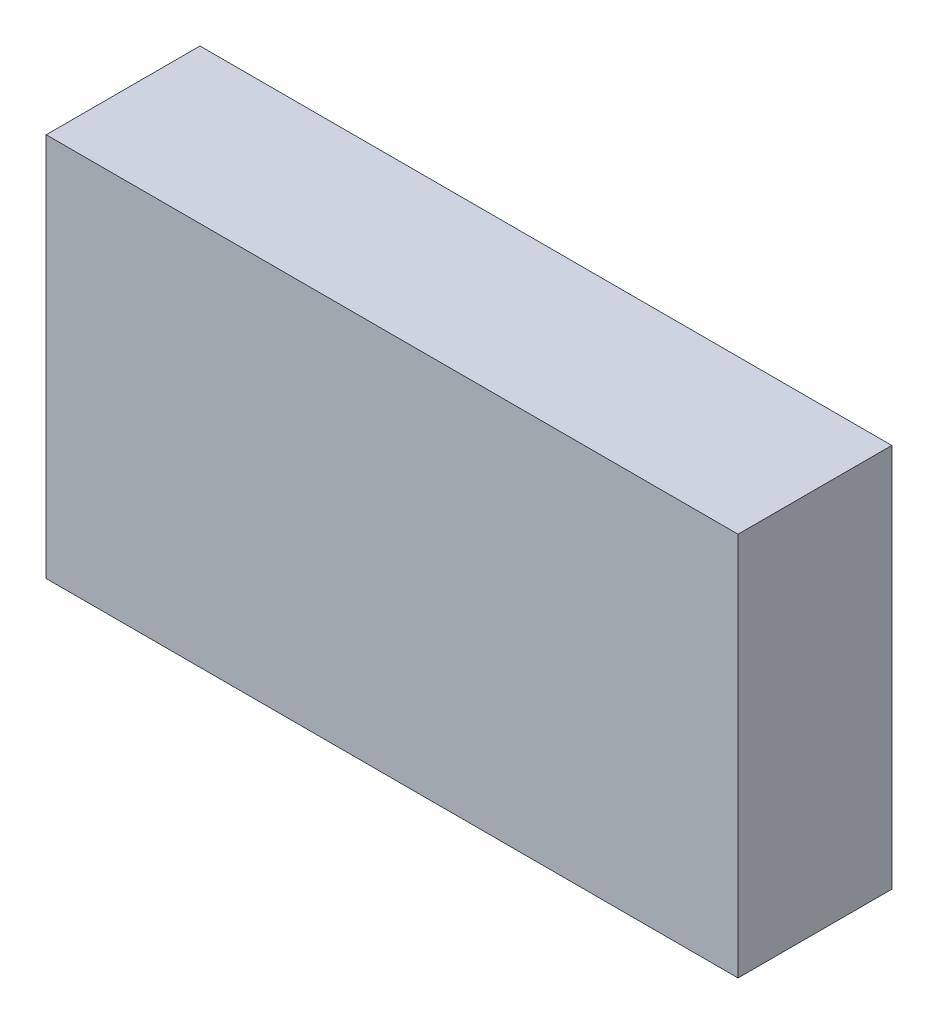
ISO-10303-21;
HEADER;
FILE_DESCRIPTION(('STEP AP214'),'2;1');
FILE_NAME('part.step','',(''),(''),'','','');
FILE_SCHEMA(('AUTOMOTIVE_DESIGN { 1 0 10303 214 1 1 1 1 }'));
ENDSEC;
DATA;
#1=APPLICATION_CONTEXT('core data for automotive mechanical design processes');
#2=APPLICATION_PROTOCOL_DEFINITION('international standard','automotive_design',2000,#1);
#3=PRODUCT_CONTEXT('',#1,'mechanical');
#4=PRODUCT('Part','Part','',(#3));
#5=PRODUCT_RELATED_PRODUCT_CATEGORY('part','',(#4));
#6=PRODUCT_DEFINITION_FORMATION('','',#4);
#7=PRODUCT_DEFINITION_CONTEXT('part definition',#1,'design');
#8=PRODUCT_DEFINITION('design','',#6,#7);
#9=PRODUCT_DEFINITION_SHAPE('','',#8);
#10=(LENGTH_UNIT() NAMED_UNIT(*) SI_UNIT(.MILLI.,.METRE.));
#11=(NAMED_UNIT(*) PLANE_ANGLE_UNIT() SI_UNIT($,.RADIAN.));
#12=(NAMED_UNIT(*) SI_UNIT($,.STERADIAN.) SOLID_ANGLE_UNIT());
#13=UNCERTAINTY_MEASURE_WITH_UNIT(LENGTH_MEASURE(1.E-05),#10,'distance_accuracy_value','');
#14=(GEOMETRIC_REPRESENTATION_CONTEXT(3) GLOBAL_UNCERTAINTY_ASSIGNED_CONTEXT((#13)) GLOBAL_UNIT_ASSIGNED_CONTEXT((#10,
#11,#12)) REPRESENTATION_CONTEXT('',''));
#15=CARTESIAN_POINT('',(0.,0.,0.));
#16=DIRECTION('',(0.,0.,1.));
#17=DIRECTION('',(1.,0.,0.));
#18=AXIS2_PLACEMENT_3D('',#15,#16,#17);
#19=CARTESIAN_POINT('',(1.6,-1.125,0.));
#20=DIRECTION('',(1.,0.,0.));
#21=DIRECTION('',(0.,0.,1.));
#22=AXIS2_PLACEMENT_3D('',#19,#20,#21);
#23=PLANE('',#22);
#24=DIRECTION('',(0.,1.,0.));
#25=VECTOR('',#24,1.);
#26=CARTESIAN_POINT('',(1.6,-1.125,0.1));
#27=LINE('',#26,#25);
#28=CARTESIAN_POINT('',(1.6,-1.125,0.1));
#29=VERTEX_POINT('',#28);
#30=CARTESIAN_POINT('',(1.6,-0.875,0.1));
#31=VERTEX_POINT('',#30);
#32=EDGE_CURVE('E11',#29,#31,#27,.T.);
#33=ORIENTED_EDGE('',*,*,#32,.T.);
#34=DIRECTION('',(0.,0.,1.));
#35=VECTOR('',#34,1.);
#36=CARTESIAN_POINT('',(1.6,-0.875,0.));
#37=LINE('',#36,#35);
#38=CARTESIAN_POINT('',(1.6,-0.875,0.));
#39=VERTEX_POINT('',#38);
#40=EDGE_CURVE('E24',#39,#31,#37,.T.);
#41=ORIENTED_EDGE('',*,*,#40,.F.);
#42=DIRECTION('',(0.,1.,0.));
#43=VECTOR('',#42,1.);
#44=CARTESIAN_POINT('',(1.6,-1.125,0.));
#45=LINE('',#44,#43);
#46=CARTESIAN_POINT('',(1.6,-1.125,0.));
#47=VERTEX_POINT('',#46);
#48=EDGE_CURVE('E86',#47,#39,#45,.T.);
#49=ORIENTED_EDGE('',*,*,#48,.F.);
#50=DIRECTION('',(0.,0.,1.));
#51=VECTOR('',#50,1.);
#52=CARTESIAN_POINT('',(1.6,-1.125,0.));
#53=LINE('',#52,#51);
#54=EDGE_CURVE('E36',#47,#29,#53,.T.);
#55=ORIENTED_EDGE('',*,*,#54,.T.);
#56=EDGE_LOOP('',(#33,#41,#49,#55));
#57=FACE_BOUND('',#56,.T.);
#58=ADVANCED_FACE('F17',(#57),#23,.F.);
#59=CARTESIAN_POINT('',(2.05,-1.125,0.));
#60=DIRECTION('',(1.,0.,0.));
#61=DIRECTION('',(0.,0.,1.));
#62=AXIS2_PLACEMENT_3D('',#59,#60,#61);
#63=PLANE('',#62);
#64=DIRECTION('',(0.,0.,1.));
#65=VECTOR('',#64,1.);
#66=CARTESIAN_POINT('',(2.05,-1.125,0.));
#67=LINE('',#66,#65);
#68=CARTESIAN_POINT('',(2.05,-1.125,0.));
#69=VERTEX_POINT('',#68);
#70=CARTESIAN_POINT('',(2.05,-1.125,0.1));
#71=VERTEX_POINT('',#70);
#72=EDGE_CURVE('E83',#69,#71,#67,.T.);
#73=ORIENTED_EDGE('',*,*,#72,.F.);
#74=DIRECTION('',(0.,1.,0.));
#75=VECTOR('',#74,1.);
#76=CARTESIAN_POINT('',(2.05,-1.125,0.));
#77=LINE('',#76,#75);
#78=CARTESIAN_POINT('',(2.05,-0.875,0.));
#79=VERTEX_POINT('',#78);
#80=EDGE_CURVE('E63',#69,#79,#77,.T.);
#81=ORIENTED_EDGE('',*,*,#80,.T.);
#82=DIRECTION('',(0.,0.,1.));
#83=VECTOR('',#82,1.);
#84=CARTESIAN_POINT('',(2.05,-0.875,0.));
#85=LINE('',#84,#83);
#86=CARTESIAN_POINT('',(2.05,-0.875,0.1));
#87=VERTEX_POINT('',#86);
#88=EDGE_CURVE('E57',#79,#87,#85,.T.);
#89=ORIENTED_EDGE('',*,*,#88,.T.);
#90=DIRECTION('',(0.,1.,0.));
#91=VECTOR('',#90,1.);
#92=CARTESIAN_POINT('',(2.05,-1.125,0.1));
#93=LINE('',#92,#91);
#94=EDGE_CURVE('E60',#71,#87,#93,.T.);
#95=ORIENTED_EDGE('',*,*,#94,.F.);
#96=EDGE_LOOP('',(#73,#81,#89,#95));
#97=FACE_BOUND('',#96,.T.);
#98=ADVANCED_FACE('F59',(#97),#63,.T.);
#99=CARTESIAN_POINT('',(1.6,-1.125,0.));
#100=DIRECTION('',(0.,1.,0.));
#101=DIRECTION('',(0.,0.,1.));
#102=AXIS2_PLACEMENT_3D('',#99,#100,#101);
#103=PLANE('',#102);
#104=ORIENTED_EDGE('',*,*,#72,.T.);
#105=DIRECTION('',(1.,0.,0.));
#106=VECTOR('',#105,1.);
#107=CARTESIAN_POINT('',(1.6,-1.125,0.1));
#108=LINE('',#107,#106);
#109=EDGE_CURVE('E71',#29,#71,#108,.T.);
#110=ORIENTED_EDGE('',*,*,#109,.F.);
#111=ORIENTED_EDGE('',*,*,#54,.F.);
#112=DIRECTION('',(1.,0.,0.));
#113=VECTOR('',#112,1.);
#114=CARTESIAN_POINT('',(1.6,-1.125,0.));
#115=LINE('',#114,#113);
#116=EDGE_CURVE('E76',#47,#69,#115,.T.);
#117=ORIENTED_EDGE('',*,*,#116,.T.);
#118=EDGE_LOOP('',(#104,#110,#111,#117));
#119=FACE_BOUND('',#118,.T.);
#120=ADVANCED_FACE('F91',(#119),#103,.F.);
#121=CARTESIAN_POINT('',(1.6,-0.875,0.));
#122=DIRECTION('',(0.,1.,0.));
#123=DIRECTION('',(0.,0.,1.));
#124=AXIS2_PLACEMENT_3D('',#121,#122,#123);
#125=PLANE('',#124);
#126=DIRECTION('',(1.,0.,0.));
#127=VECTOR('',#126,1.);
#128=CARTESIAN_POINT('',(1.6,-0.875,0.));
#129=LINE('',#128,#127);
#130=EDGE_CURVE('E74',#39,#79,#129,.T.);
#131=ORIENTED_EDGE('',*,*,#130,.F.);
#132=ORIENTED_EDGE('',*,*,#40,.T.);
#133=DIRECTION('',(1.,0.,0.));
#134=VECTOR('',#133,1.);
#135=CARTESIAN_POINT('',(1.6,-0.875,0.1));
#136=LINE('',#135,#134);
#137=EDGE_CURVE('E69',#31,#87,#136,.T.);
#138=ORIENTED_EDGE('',*,*,#137,.T.);
#139=ORIENTED_EDGE('',*,*,#88,.F.);
#140=EDGE_LOOP('',(#131,#132,#138,#139));
#141=FACE_BOUND('',#140,.T.);
#142=ADVANCED_FACE('F73',(#141),#125,.T.);
#143=CARTESIAN_POINT('',(1.6,-1.125,0.));
#144=DIRECTION('',(0.,0.,1.));
#145=DIRECTION('',(1.,0.,0.));
#146=AXIS2_PLACEMENT_3D('',#143,#144,#145);
#147=PLANE('',#146);
#148=ORIENTED_EDGE('',*,*,#130,.T.);
#149=ORIENTED_EDGE('',*,*,#80,.F.);
#150=ORIENTED_EDGE('',*,*,#116,.F.);
#151=ORIENTED_EDGE('',*,*,#48,.T.);
#152=EDGE_LOOP('',(#148,#149,#150,#151));
#153=FACE_BOUND('',#152,.T.);
#154=ADVANCED_FACE('F89',(#153),#147,.F.);
#155=CARTESIAN_POINT('',(1.6,-1.125,0.1));
#156=DIRECTION('',(0.,0.,1.));
#157=DIRECTION('',(1.,0.,0.));
#158=AXIS2_PLACEMENT_3D('',#155,#156,#157);
#159=PLANE('',#158);
#160=ORIENTED_EDGE('',*,*,#32,.F.);
#161=ORIENTED_EDGE('',*,*,#109,.T.);
#162=ORIENTED_EDGE('',*,*,#94,.T.);
#163=ORIENTED_EDGE('',*,*,#137,.F.);
#164=EDGE_LOOP('',(#160,#161,#162,#163));
#165=FACE_BOUND('',#164,.T.);
#166=ADVANCED_FACE('F68',(#165),#159,.T.);
#167=CLOSED_SHELL('',(#58,#98,#120,#142,#154,#166));
#168=MANIFOLD_SOLID_BREP('B1',#167);
#169=ADVANCED_BREP_SHAPE_REPRESENTATION('',(#18,#168),#14);
#170=SHAPE_DEFINITION_REPRESENTATION(#9,#169);
ENDSEC;
END-ISO-10303-21;
